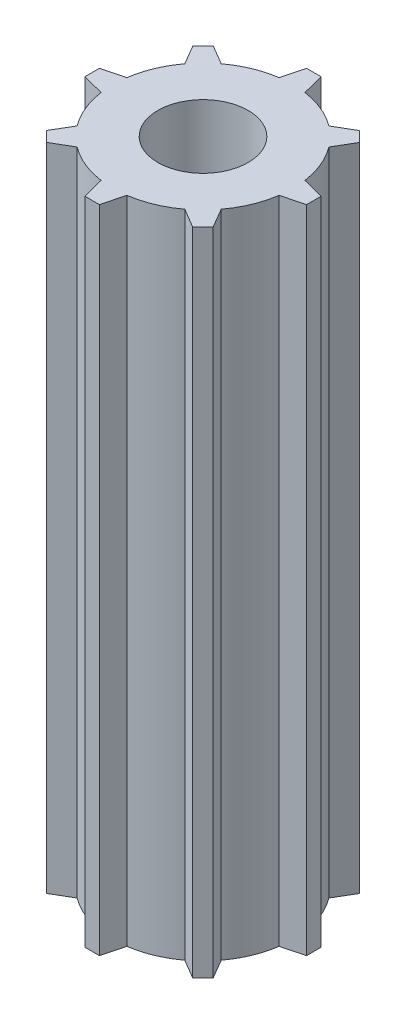
ISO-10303-21;
HEADER;
FILE_DESCRIPTION(('STEP AP214'),'2;1');
FILE_NAME('part.step','',(''),(''),'','','');
FILE_SCHEMA(('AUTOMOTIVE_DESIGN { 1 0 10303 214 1 1 1 1 }'));
ENDSEC;
DATA;
#1=APPLICATION_CONTEXT('core data for automotive mechanical design processes');
#2=APPLICATION_PROTOCOL_DEFINITION('international standard','automotive_design',2000,#1);
#3=PRODUCT_CONTEXT('',#1,'mechanical');
#4=PRODUCT('Part','Part','',(#3));
#5=PRODUCT_RELATED_PRODUCT_CATEGORY('part','',(#4));
#6=PRODUCT_DEFINITION_FORMATION('','',#4);
#7=PRODUCT_DEFINITION_CONTEXT('part definition',#1,'design');
#8=PRODUCT_DEFINITION('design','',#6,#7);
#9=PRODUCT_DEFINITION_SHAPE('','',#8);
#10=(LENGTH_UNIT() NAMED_UNIT(*) SI_UNIT(.MILLI.,.METRE.));
#11=(NAMED_UNIT(*) PLANE_ANGLE_UNIT() SI_UNIT($,.RADIAN.));
#12=(NAMED_UNIT(*) SI_UNIT($,.STERADIAN.) SOLID_ANGLE_UNIT());
#13=UNCERTAINTY_MEASURE_WITH_UNIT(LENGTH_MEASURE(1.E-05),#10,'distance_accuracy_value','');
#14=(GEOMETRIC_REPRESENTATION_CONTEXT(3) GLOBAL_UNCERTAINTY_ASSIGNED_CONTEXT((#13)) GLOBAL_UNIT_ASSIGNED_CONTEXT((#10,
#11,#12)) REPRESENTATION_CONTEXT('',''));
#15=CARTESIAN_POINT('',(0.,0.,0.));
#16=DIRECTION('',(0.,0.,1.));
#17=DIRECTION('',(1.,0.,0.));
#18=AXIS2_PLACEMENT_3D('',#15,#16,#17);
#19=CARTESIAN_POINT('',(-0.505053708742684,45.72,-7.78879571792839));
#20=DIRECTION('',(0.,0.,1.));
#21=DIRECTION('',(1.,0.,0.));
#22=AXIS2_PLACEMENT_3D('',#19,#20,#21);
#23=PLANE('',#22);
#24=DIRECTION('',(-1.,0.,0.));
#25=VECTOR('',#24,1.);
#26=CARTESIAN_POINT('',(-0.505053708742684,0.,-7.78879571792839));
#27=LINE('',#26,#25);
#28=CARTESIAN_POINT('',(0.510946291257316,0.,-7.78879571792839));
#29=VERTEX_POINT('',#28);
#30=CARTESIAN_POINT('',(-0.505053708742684,0.,-7.78879571792839));
#31=VERTEX_POINT('',#30);
#32=EDGE_CURVE('E279',#29,#31,#27,.T.);
#33=ORIENTED_EDGE('',*,*,#32,.T.);
#34=DIRECTION('',(0.,-1.,0.));
#35=VECTOR('',#34,1.);
#36=CARTESIAN_POINT('',(-0.505053708742684,45.72,-7.78879571792839));
#37=LINE('',#36,#35);
#38=CARTESIAN_POINT('',(-0.505053708742684,45.72,-7.78879571792839));
#39=VERTEX_POINT('',#38);
#40=EDGE_CURVE('E11',#39,#31,#37,.T.);
#41=ORIENTED_EDGE('',*,*,#40,.F.);
#42=DIRECTION('',(-1.,0.,0.));
#43=VECTOR('',#42,1.);
#44=CARTESIAN_POINT('',(-0.505053708742684,45.72,-7.78879571792839));
#45=LINE('',#44,#43);
#46=CARTESIAN_POINT('',(0.510946291257316,45.72,-7.78879571792839));
#47=VERTEX_POINT('',#46);
#48=EDGE_CURVE('E342',#47,#39,#45,.T.);
#49=ORIENTED_EDGE('',*,*,#48,.F.);
#50=DIRECTION('',(0.,-1.,0.));
#51=VECTOR('',#50,1.);
#52=CARTESIAN_POINT('',(0.510946291257316,45.72,-7.78879571792839));
#53=LINE('',#52,#51);
#54=EDGE_CURVE('E275',#47,#29,#53,.T.);
#55=ORIENTED_EDGE('',*,*,#54,.T.);
#56=EDGE_LOOP('',(#33,#41,#49,#55));
#57=FACE_BOUND('',#56,.T.);
#58=ADVANCED_FACE('F39',(#57),#23,.F.);
#59=CARTESIAN_POINT('',(-0.905835841654313,45.72,-6.25939506565726));
#60=DIRECTION('',(0.967337362785917,0.,0.253492458582867));
#61=DIRECTION('',(0.253492458582867,0.,-0.967337362785917));
#62=AXIS2_PLACEMENT_3D('',#59,#60,#61);
#63=PLANE('',#62);
#64=DIRECTION('',(-0.253492458582867,0.,0.967337362785917));
#65=VECTOR('',#64,1.);
#66=CARTESIAN_POINT('',(-0.905835841654313,0.,-6.25939506565726));
#67=LINE('',#66,#65);
#68=CARTESIAN_POINT('',(-0.905835841654313,0.,-6.25939506565726));
#69=VERTEX_POINT('',#68);
#70=EDGE_CURVE('E282',#31,#69,#67,.T.);
#71=ORIENTED_EDGE('',*,*,#70,.T.);
#72=DIRECTION('',(0.,-1.,0.));
#73=VECTOR('',#72,1.);
#74=CARTESIAN_POINT('',(-0.905835841654313,45.72,-6.25939506565726));
#75=LINE('',#74,#73);
#76=CARTESIAN_POINT('',(-0.905835841654313,45.72,-6.25939506565726));
#77=VERTEX_POINT('',#76);
#78=EDGE_CURVE('E47',#77,#69,#75,.T.);
#79=ORIENTED_EDGE('',*,*,#78,.F.);
#80=DIRECTION('',(-0.253492458582867,0.,0.967337362785917));
#81=VECTOR('',#80,1.);
#82=CARTESIAN_POINT('',(-0.905835841654313,45.72,-6.25939506565726));
#83=LINE('',#82,#81);
#84=EDGE_CURVE('E170',#39,#77,#83,.T.);
#85=ORIENTED_EDGE('',*,*,#84,.F.);
#86=ORIENTED_EDGE('',*,*,#40,.T.);
#87=EDGE_LOOP('',(#71,#79,#85,#86));
#88=FACE_BOUND('',#87,.T.);
#89=ADVANCED_FACE('F522',(#88),#63,.F.);
#90=CARTESIAN_POINT('',(0.,45.72,0.));
#91=DIRECTION('',(0.,-1.,0.));
#92=DIRECTION('',(0.,0.,-1.));
#93=AXIS2_PLACEMENT_3D('',#90,#91,#92);
#94=CYLINDRICAL_SURFACE('',#93,6.3246);
#95=CARTESIAN_POINT('',(0.,0.,0.));
#96=DIRECTION('',(0.,1.,0.));
#97=DIRECTION('',(0.,0.,1.));
#98=AXIS2_PLACEMENT_3D('',#95,#96,#97);
#99=CIRCLE('',#98,6.3246);
#100=CARTESIAN_POINT('',(-3.78553803077796,0.,-5.06658336332619));
#101=VERTEX_POINT('',#100);
#102=EDGE_CURVE('E285',#69,#101,#99,.T.);
#103=ORIENTED_EDGE('',*,*,#102,.T.);
#104=DIRECTION('',(0.,-1.,0.));
#105=VECTOR('',#104,1.);
#106=CARTESIAN_POINT('',(-3.78553803077796,45.72,-5.06658336332619));
#107=LINE('',#106,#105);
#108=CARTESIAN_POINT('',(-3.78553803077796,45.72,-5.06658336332619));
#109=VERTEX_POINT('',#108);
#110=EDGE_CURVE('E421',#109,#101,#107,.T.);
#111=ORIENTED_EDGE('',*,*,#110,.F.);
#112=CARTESIAN_POINT('',(0.,45.72,0.));
#113=DIRECTION('',(0.,1.,0.));
#114=DIRECTION('',(0.,0.,1.));
#115=AXIS2_PLACEMENT_3D('',#112,#113,#114);
#116=CIRCLE('',#115,6.3246);
#117=EDGE_CURVE('E429',#77,#109,#116,.T.);
#118=ORIENTED_EDGE('',*,*,#117,.F.);
#119=ORIENTED_EDGE('',*,*,#78,.T.);
#120=EDGE_LOOP('',(#103,#111,#118,#119));
#121=FACE_BOUND('',#120,.T.);
#122=ADVANCED_FACE('F427',(#121),#94,.T.);
#123=CARTESIAN_POINT('',(-3.78553803077796,45.72,-5.06658336332619));
#124=DIRECTION('',(-0.507876501584818,0.,0.861429892178096));
#125=DIRECTION('',(0.861429892178096,0.,0.507876501584818));
#126=AXIS2_PLACEMENT_3D('',#123,#124,#125);
#127=PLANE('',#126);
#128=DIRECTION('',(-0.861429892178096,0.,-0.507876501584818));
#129=VECTOR('',#128,1.);
#130=CARTESIAN_POINT('',(-3.78553803077796,0.,-5.06658336332619));
#131=LINE('',#130,#129);
#132=CARTESIAN_POINT('',(-5.14621668205375,0.,-5.86880385679407));
#133=VERTEX_POINT('',#132);
#134=EDGE_CURVE('E287',#101,#133,#131,.T.);
#135=ORIENTED_EDGE('',*,*,#134,.T.);
#136=DIRECTION('',(0.,-1.,0.));
#137=VECTOR('',#136,1.);
#138=CARTESIAN_POINT('',(-5.14621668205375,45.72,-5.86880385679407));
#139=LINE('',#138,#137);
#140=CARTESIAN_POINT('',(-5.14621668205375,45.72,-5.86880385679407));
#141=VERTEX_POINT('',#140);
#142=EDGE_CURVE('E418',#141,#133,#139,.T.);
#143=ORIENTED_EDGE('',*,*,#142,.F.);
#144=DIRECTION('',(-0.861429892178096,0.,-0.507876501584818));
#145=VECTOR('',#144,1.);
#146=CARTESIAN_POINT('',(-3.78553803077796,45.72,-5.06658336332619));
#147=LINE('',#146,#145);
#148=EDGE_CURVE('E447',#109,#141,#147,.T.);
#149=ORIENTED_EDGE('',*,*,#148,.F.);
#150=ORIENTED_EDGE('',*,*,#110,.T.);
#151=EDGE_LOOP('',(#135,#143,#149,#150));
#152=FACE_BOUND('',#151,.T.);
#153=ADVANCED_FACE('F438',(#152),#127,.F.);
#154=CARTESIAN_POINT('',(-5.86463717173928,45.72,-5.15038336710854));
#155=DIRECTION('',(0.707106781186549,0.,0.707106781186546));
#156=DIRECTION('',(0.707106781186546,0.,-0.707106781186549));
#157=AXIS2_PLACEMENT_3D('',#154,#155,#156);
#158=PLANE('',#157);
#159=DIRECTION('',(-0.707106781186546,0.,0.707106781186549));
#160=VECTOR('',#159,1.);
#161=CARTESIAN_POINT('',(-5.86463717173928,0.,-5.15038336710854));
#162=LINE('',#161,#160);
#163=CARTESIAN_POINT('',(-5.86463717173928,0.,-5.15038336710854));
#164=VERTEX_POINT('',#163);
#165=EDGE_CURVE('E289',#133,#164,#162,.T.);
#166=ORIENTED_EDGE('',*,*,#165,.T.);
#167=DIRECTION('',(0.,-1.,0.));
#168=VECTOR('',#167,1.);
#169=CARTESIAN_POINT('',(-5.86463717173928,45.72,-5.15038336710854));
#170=LINE('',#169,#168);
#171=CARTESIAN_POINT('',(-5.86463717173928,45.72,-5.15038336710854));
#172=VERTEX_POINT('',#171);
#173=EDGE_CURVE('E415',#172,#164,#170,.T.);
#174=ORIENTED_EDGE('',*,*,#173,.F.);
#175=DIRECTION('',(-0.707106781186546,0.,0.707106781186549));
#176=VECTOR('',#175,1.);
#177=CARTESIAN_POINT('',(-5.86463717173928,45.72,-5.15038336710854));
#178=LINE('',#177,#176);
#179=EDGE_CURVE('E444',#141,#172,#178,.T.);
#180=ORIENTED_EDGE('',*,*,#179,.F.);
#181=ORIENTED_EDGE('',*,*,#142,.T.);
#182=EDGE_LOOP('',(#166,#174,#180,#181));
#183=FACE_BOUND('',#182,.T.);
#184=ADVANCED_FACE('F442',(#183),#158,.F.);
#185=CARTESIAN_POINT('',(-5.06658336332745,45.72,-3.78553803077627));
#186=DIRECTION('',(0.863257045364629,0.,-0.504764572477438));
#187=DIRECTION('',(-0.504764572477438,0.,-0.863257045364629));
#188=AXIS2_PLACEMENT_3D('',#185,#186,#187);
#189=PLANE('',#188);
#190=DIRECTION('',(0.504764572477438,0.,0.863257045364629));
#191=VECTOR('',#190,1.);
#192=CARTESIAN_POINT('',(-5.06658336332745,0.,-3.78553803077627));
#193=LINE('',#192,#191);
#194=CARTESIAN_POINT('',(-5.06658336332745,0.,-3.78553803077627));
#195=VERTEX_POINT('',#194);
#196=EDGE_CURVE('E291',#164,#195,#193,.T.);
#197=ORIENTED_EDGE('',*,*,#196,.T.);
#198=DIRECTION('',(0.,-1.,0.));
#199=VECTOR('',#198,1.);
#200=CARTESIAN_POINT('',(-5.06658336332745,45.72,-3.78553803077627));
#201=LINE('',#200,#199);
#202=CARTESIAN_POINT('',(-5.06658336332745,45.72,-3.78553803077627));
#203=VERTEX_POINT('',#202);
#204=EDGE_CURVE('E412',#203,#195,#201,.T.);
#205=ORIENTED_EDGE('',*,*,#204,.F.);
#206=DIRECTION('',(0.504764572477438,0.,0.863257045364629));
#207=VECTOR('',#206,1.);
#208=CARTESIAN_POINT('',(-5.06658336332745,45.72,-3.78553803077627));
#209=LINE('',#208,#207);
#210=EDGE_CURVE('E446',#172,#203,#209,.T.);
#211=ORIENTED_EDGE('',*,*,#210,.F.);
#212=ORIENTED_EDGE('',*,*,#173,.T.);
#213=EDGE_LOOP('',(#197,#205,#211,#212));
#214=FACE_BOUND('',#213,.T.);
#215=ADVANCED_FACE('F535',(#214),#189,.F.);
#216=CARTESIAN_POINT('',(0.,45.72,0.));
#217=DIRECTION('',(0.,-1.,0.));
#218=DIRECTION('',(0.,0.,-1.));
#219=AXIS2_PLACEMENT_3D('',#216,#217,#218);
#220=CYLINDRICAL_SURFACE('',#219,6.3246);
#221=CARTESIAN_POINT('',(0.,0.,0.));
#222=DIRECTION('',(0.,1.,0.));
#223=DIRECTION('',(0.,0.,1.));
#224=AXIS2_PLACEMENT_3D('',#221,#222,#223);
#225=CIRCLE('',#224,6.3246);
#226=CARTESIAN_POINT('',(-6.25939506565756,0.,-0.905835841652232));
#227=VERTEX_POINT('',#226);
#228=EDGE_CURVE('E293',#195,#227,#225,.T.);
#229=ORIENTED_EDGE('',*,*,#228,.T.);
#230=DIRECTION('',(0.,-1.,0.));
#231=VECTOR('',#230,1.);
#232=CARTESIAN_POINT('',(-6.25939506565756,45.72,-0.905835841652232));
#233=LINE('',#232,#231);
#234=CARTESIAN_POINT('',(-6.25939506565756,45.72,-0.905835841652232));
#235=VERTEX_POINT('',#234);
#236=EDGE_CURVE('E409',#235,#227,#233,.T.);
#237=ORIENTED_EDGE('',*,*,#236,.F.);
#238=CARTESIAN_POINT('',(0.,45.72,0.));
#239=DIRECTION('',(0.,1.,0.));
#240=DIRECTION('',(0.,0.,1.));
#241=AXIS2_PLACEMENT_3D('',#238,#239,#240);
#242=CIRCLE('',#241,6.3246);
#243=EDGE_CURVE('E449',#203,#235,#242,.T.);
#244=ORIENTED_EDGE('',*,*,#243,.F.);
#245=ORIENTED_EDGE('',*,*,#204,.T.);
#246=EDGE_LOOP('',(#229,#237,#244,#245));
#247=FACE_BOUND('',#246,.T.);
#248=ADVANCED_FACE('F538',(#247),#220,.T.);
#249=CARTESIAN_POINT('',(-6.25939506565756,45.72,-0.905835841652232));
#250=DIRECTION('',(0.250000000000002,0.,0.968245836551854));
#251=DIRECTION('',(0.968245836551854,0.,-0.250000000000002));
#252=AXIS2_PLACEMENT_3D('',#249,#250,#251);
#253=PLANE('',#252);
#254=DIRECTION('',(-0.968245836551854,0.,0.250000000000002));
#255=VECTOR('',#254,1.);
#256=CARTESIAN_POINT('',(-6.25939506565756,0.,-0.905835841652232));
#257=LINE('',#256,#255);
#258=CARTESIAN_POINT('',(-7.78879571792839,0.,-0.510946291257314));
#259=VERTEX_POINT('',#258);
#260=EDGE_CURVE('E295',#227,#259,#257,.T.);
#261=ORIENTED_EDGE('',*,*,#260,.T.);
#262=DIRECTION('',(0.,-1.,0.));
#263=VECTOR('',#262,1.);
#264=CARTESIAN_POINT('',(-7.78879571792839,45.72,-0.510946291257314));
#265=LINE('',#264,#263);
#266=CARTESIAN_POINT('',(-7.78879571792839,45.72,-0.510946291257314));
#267=VERTEX_POINT('',#266);
#268=EDGE_CURVE('E406',#267,#259,#265,.T.);
#269=ORIENTED_EDGE('',*,*,#268,.F.);
#270=DIRECTION('',(-0.968245836551854,0.,0.250000000000002));
#271=VECTOR('',#270,1.);
#272=CARTESIAN_POINT('',(-6.25939506565756,45.72,-0.905835841652232));
#273=LINE('',#272,#271);
#274=EDGE_CURVE('E455',#235,#267,#273,.T.);
#275=ORIENTED_EDGE('',*,*,#274,.F.);
#276=ORIENTED_EDGE('',*,*,#236,.T.);
#277=EDGE_LOOP('',(#261,#269,#275,#276));
#278=FACE_BOUND('',#277,.T.);
#279=ADVANCED_FACE('F542',(#278),#253,.F.);
#280=CARTESIAN_POINT('',(-7.78879571792839,45.72,0.505053708742686));
#281=DIRECTION('',(1.,0.,0.));
#282=DIRECTION('',(0.,0.,-1.));
#283=AXIS2_PLACEMENT_3D('',#280,#281,#282);
#284=PLANE('',#283);
#285=DIRECTION('',(0.,0.,1.));
#286=VECTOR('',#285,1.);
#287=CARTESIAN_POINT('',(-7.78879571792839,0.,0.505053708742686));
#288=LINE('',#287,#286);
#289=CARTESIAN_POINT('',(-7.78879571792839,0.,0.505053708742686));
#290=VERTEX_POINT('',#289);
#291=EDGE_CURVE('E297',#259,#290,#288,.T.);
#292=ORIENTED_EDGE('',*,*,#291,.T.);
#293=DIRECTION('',(0.,-1.,0.));
#294=VECTOR('',#293,1.);
#295=CARTESIAN_POINT('',(-7.78879571792839,45.72,0.505053708742686));
#296=LINE('',#295,#294);
#297=CARTESIAN_POINT('',(-7.78879571792839,45.72,0.505053708742686));
#298=VERTEX_POINT('',#297);
#299=EDGE_CURVE('E403',#298,#290,#296,.T.);
#300=ORIENTED_EDGE('',*,*,#299,.F.);
#301=DIRECTION('',(0.,0.,1.));
#302=VECTOR('',#301,1.);
#303=CARTESIAN_POINT('',(-7.78879571792839,45.72,0.505053708742686));
#304=LINE('',#303,#302);
#305=EDGE_CURVE('E457',#267,#298,#304,.T.);
#306=ORIENTED_EDGE('',*,*,#305,.F.);
#307=ORIENTED_EDGE('',*,*,#268,.T.);
#308=EDGE_LOOP('',(#292,#300,#306,#307));
#309=FACE_BOUND('',#308,.T.);
#310=ADVANCED_FACE('F546',(#309),#284,.F.);
#311=CARTESIAN_POINT('',(-6.25939506565726,45.72,0.905835841654314));
#312=DIRECTION('',(0.253492458582867,0.,-0.967337362785917));
#313=DIRECTION('',(-0.967337362785917,0.,-0.253492458582867));
#314=AXIS2_PLACEMENT_3D('',#311,#312,#313);
#315=PLANE('',#314);
#316=DIRECTION('',(0.967337362785917,0.,0.253492458582867));
#317=VECTOR('',#316,1.);
#318=CARTESIAN_POINT('',(-6.25939506565726,0.,0.905835841654314));
#319=LINE('',#318,#317);
#320=CARTESIAN_POINT('',(-6.25939506565726,0.,0.905835841654314));
#321=VERTEX_POINT('',#320);
#322=EDGE_CURVE('E299',#290,#321,#319,.T.);
#323=ORIENTED_EDGE('',*,*,#322,.T.);
#324=DIRECTION('',(0.,-1.,0.));
#325=VECTOR('',#324,1.);
#326=CARTESIAN_POINT('',(-6.25939506565726,45.72,0.905835841654314));
#327=LINE('',#326,#325);
#328=CARTESIAN_POINT('',(-6.25939506565726,45.72,0.905835841654314));
#329=VERTEX_POINT('',#328);
#330=EDGE_CURVE('E400',#329,#321,#327,.T.);
#331=ORIENTED_EDGE('',*,*,#330,.F.);
#332=DIRECTION('',(0.967337362785917,0.,0.253492458582867));
#333=VECTOR('',#332,1.);
#334=CARTESIAN_POINT('',(-6.25939506565726,45.72,0.905835841654314));
#335=LINE('',#334,#333);
#336=EDGE_CURVE('E459',#298,#329,#335,.T.);
#337=ORIENTED_EDGE('',*,*,#336,.F.);
#338=ORIENTED_EDGE('',*,*,#299,.T.);
#339=EDGE_LOOP('',(#323,#331,#337,#338));
#340=FACE_BOUND('',#339,.T.);
#341=ADVANCED_FACE('F550',(#340),#315,.F.);
#342=CARTESIAN_POINT('',(0.,45.72,0.));
#343=DIRECTION('',(0.,-1.,0.));
#344=DIRECTION('',(0.,0.,-1.));
#345=AXIS2_PLACEMENT_3D('',#342,#343,#344);
#346=CYLINDRICAL_SURFACE('',#345,6.3246);
#347=CARTESIAN_POINT('',(0.,0.,0.));
#348=DIRECTION('',(0.,1.,0.));
#349=DIRECTION('',(0.,0.,1.));
#350=AXIS2_PLACEMENT_3D('',#347,#348,#349);
#351=CIRCLE('',#350,6.3246);
#352=CARTESIAN_POINT('',(-5.06658336332619,0.,3.78553803077796));
#353=VERTEX_POINT('',#352);
#354=EDGE_CURVE('E301',#321,#353,#351,.T.);
#355=ORIENTED_EDGE('',*,*,#354,.T.);
#356=DIRECTION('',(0.,-1.,0.));
#357=VECTOR('',#356,1.);
#358=CARTESIAN_POINT('',(-5.06658336332619,45.72,3.78553803077796));
#359=LINE('',#358,#357);
#360=CARTESIAN_POINT('',(-5.06658336332619,45.72,3.78553803077796));
#361=VERTEX_POINT('',#360);
#362=EDGE_CURVE('E397',#361,#353,#359,.T.);
#363=ORIENTED_EDGE('',*,*,#362,.F.);
#364=CARTESIAN_POINT('',(0.,45.72,0.));
#365=DIRECTION('',(0.,1.,0.));
#366=DIRECTION('',(0.,0.,1.));
#367=AXIS2_PLACEMENT_3D('',#364,#365,#366);
#368=CIRCLE('',#367,6.3246);
#369=EDGE_CURVE('E461',#329,#361,#368,.T.);
#370=ORIENTED_EDGE('',*,*,#369,.F.);
#371=ORIENTED_EDGE('',*,*,#330,.T.);
#372=EDGE_LOOP('',(#355,#363,#370,#371));
#373=FACE_BOUND('',#372,.T.);
#374=ADVANCED_FACE('F554',(#373),#346,.T.);
#375=CARTESIAN_POINT('',(-5.06658336332619,45.72,3.78553803077796));
#376=DIRECTION('',(0.861429892178096,0.,0.507876501584818));
#377=DIRECTION('',(0.507876501584818,0.,-0.861429892178096));
#378=AXIS2_PLACEMENT_3D('',#375,#376,#377);
#379=PLANE('',#378);
#380=DIRECTION('',(-0.507876501584818,0.,0.861429892178096));
#381=VECTOR('',#380,1.);
#382=CARTESIAN_POINT('',(-5.06658336332619,0.,3.78553803077796));
#383=LINE('',#382,#381);
#384=CARTESIAN_POINT('',(-5.86880385679407,0.,5.14621668205375));
#385=VERTEX_POINT('',#384);
#386=EDGE_CURVE('E303',#353,#385,#383,.T.);
#387=ORIENTED_EDGE('',*,*,#386,.T.);
#388=DIRECTION('',(0.,-1.,0.));
#389=VECTOR('',#388,1.);
#390=CARTESIAN_POINT('',(-5.86880385679407,45.72,5.14621668205375));
#391=LINE('',#390,#389);
#392=CARTESIAN_POINT('',(-5.86880385679407,45.72,5.14621668205375));
#393=VERTEX_POINT('',#392);
#394=EDGE_CURVE('E394',#393,#385,#391,.T.);
#395=ORIENTED_EDGE('',*,*,#394,.F.);
#396=DIRECTION('',(-0.507876501584818,0.,0.861429892178096));
#397=VECTOR('',#396,1.);
#398=CARTESIAN_POINT('',(-5.06658336332619,45.72,3.78553803077796));
#399=LINE('',#398,#397);
#400=EDGE_CURVE('E463',#361,#393,#399,.T.);
#401=ORIENTED_EDGE('',*,*,#400,.F.);
#402=ORIENTED_EDGE('',*,*,#362,.T.);
#403=EDGE_LOOP('',(#387,#395,#401,#402));
#404=FACE_BOUND('',#403,.T.);
#405=ADVANCED_FACE('F558',(#404),#379,.F.);
#406=CARTESIAN_POINT('',(-5.15038336710854,45.72,5.86463717173928));
#407=DIRECTION('',(0.707106781186546,0.,-0.707106781186549));
#408=DIRECTION('',(-0.707106781186549,0.,-0.707106781186546));
#409=AXIS2_PLACEMENT_3D('',#406,#407,#408);
#410=PLANE('',#409);
#411=DIRECTION('',(0.707106781186549,0.,0.707106781186546));
#412=VECTOR('',#411,1.);
#413=CARTESIAN_POINT('',(-5.15038336710854,0.,5.86463717173928));
#414=LINE('',#413,#412);
#415=CARTESIAN_POINT('',(-5.15038336710854,0.,5.86463717173928));
#416=VERTEX_POINT('',#415);
#417=EDGE_CURVE('E305',#385,#416,#414,.T.);
#418=ORIENTED_EDGE('',*,*,#417,.T.);
#419=DIRECTION('',(0.,-1.,0.));
#420=VECTOR('',#419,1.);
#421=CARTESIAN_POINT('',(-5.15038336710854,45.72,5.86463717173928));
#422=LINE('',#421,#420);
#423=CARTESIAN_POINT('',(-5.15038336710854,45.72,5.86463717173928));
#424=VERTEX_POINT('',#423);
#425=EDGE_CURVE('E391',#424,#416,#422,.T.);
#426=ORIENTED_EDGE('',*,*,#425,.F.);
#427=DIRECTION('',(0.707106781186549,0.,0.707106781186546));
#428=VECTOR('',#427,1.);
#429=CARTESIAN_POINT('',(-5.15038336710854,45.72,5.86463717173928));
#430=LINE('',#429,#428);
#431=EDGE_CURVE('E465',#393,#424,#430,.T.);
#432=ORIENTED_EDGE('',*,*,#431,.F.);
#433=ORIENTED_EDGE('',*,*,#394,.T.);
#434=EDGE_LOOP('',(#418,#426,#432,#433));
#435=FACE_BOUND('',#434,.T.);
#436=ADVANCED_FACE('F562',(#435),#410,.F.);
#437=CARTESIAN_POINT('',(-3.78553803077627,45.72,5.06658336332745));
#438=DIRECTION('',(-0.504764572477438,0.,-0.863257045364629));
#439=DIRECTION('',(-0.863257045364629,0.,0.504764572477438));
#440=AXIS2_PLACEMENT_3D('',#437,#438,#439);
#441=PLANE('',#440);
#442=DIRECTION('',(0.863257045364629,0.,-0.504764572477438));
#443=VECTOR('',#442,1.);
#444=CARTESIAN_POINT('',(-3.78553803077627,0.,5.06658336332745));
#445=LINE('',#444,#443);
#446=CARTESIAN_POINT('',(-3.78553803077627,0.,5.06658336332745));
#447=VERTEX_POINT('',#446);
#448=EDGE_CURVE('E307',#416,#447,#445,.T.);
#449=ORIENTED_EDGE('',*,*,#448,.T.);
#450=DIRECTION('',(0.,-1.,0.));
#451=VECTOR('',#450,1.);
#452=CARTESIAN_POINT('',(-3.78553803077627,45.72,5.06658336332745));
#453=LINE('',#452,#451);
#454=CARTESIAN_POINT('',(-3.78553803077627,45.72,5.06658336332745));
#455=VERTEX_POINT('',#454);
#456=EDGE_CURVE('E388',#455,#447,#453,.T.);
#457=ORIENTED_EDGE('',*,*,#456,.F.);
#458=DIRECTION('',(0.863257045364629,0.,-0.504764572477438));
#459=VECTOR('',#458,1.);
#460=CARTESIAN_POINT('',(-3.78553803077627,45.72,5.06658336332745));
#461=LINE('',#460,#459);
#462=EDGE_CURVE('E467',#424,#455,#461,.T.);
#463=ORIENTED_EDGE('',*,*,#462,.F.);
#464=ORIENTED_EDGE('',*,*,#425,.T.);
#465=EDGE_LOOP('',(#449,#457,#463,#464));
#466=FACE_BOUND('',#465,.T.);
#467=ADVANCED_FACE('F566',(#466),#441,.F.);
#468=CARTESIAN_POINT('',(0.,45.72,0.));
#469=DIRECTION('',(0.,-1.,0.));
#470=DIRECTION('',(0.,0.,-1.));
#471=AXIS2_PLACEMENT_3D('',#468,#469,#470);
#472=CYLINDRICAL_SURFACE('',#471,6.3246);
#473=CARTESIAN_POINT('',(0.,0.,0.));
#474=DIRECTION('',(0.,1.,0.));
#475=DIRECTION('',(0.,0.,1.));
#476=AXIS2_PLACEMENT_3D('',#473,#474,#475);
#477=CIRCLE('',#476,6.3246);
#478=CARTESIAN_POINT('',(-0.905835841652233,0.,6.25939506565756));
#479=VERTEX_POINT('',#478);
#480=EDGE_CURVE('E309',#447,#479,#477,.T.);
#481=ORIENTED_EDGE('',*,*,#480,.T.);
#482=DIRECTION('',(0.,-1.,0.));
#483=VECTOR('',#482,1.);
#484=CARTESIAN_POINT('',(-0.905835841652233,45.72,6.25939506565756));
#485=LINE('',#484,#483);
#486=CARTESIAN_POINT('',(-0.905835841652233,45.72,6.25939506565756));
#487=VERTEX_POINT('',#486);
#488=EDGE_CURVE('E385',#487,#479,#485,.T.);
#489=ORIENTED_EDGE('',*,*,#488,.F.);
#490=CARTESIAN_POINT('',(0.,45.72,0.));
#491=DIRECTION('',(0.,1.,0.));
#492=DIRECTION('',(0.,0.,1.));
#493=AXIS2_PLACEMENT_3D('',#490,#491,#492);
#494=CIRCLE('',#493,6.3246);
#495=EDGE_CURVE('E469',#455,#487,#494,.T.);
#496=ORIENTED_EDGE('',*,*,#495,.F.);
#497=ORIENTED_EDGE('',*,*,#456,.T.);
#498=EDGE_LOOP('',(#481,#489,#496,#497));
#499=FACE_BOUND('',#498,.T.);
#500=ADVANCED_FACE('F570',(#499),#472,.T.);
#501=CARTESIAN_POINT('',(-0.905835841652232,45.72,6.25939506565756));
#502=DIRECTION('',(0.968245836551854,0.,-0.250000000000002));
#503=DIRECTION('',(-0.250000000000002,0.,-0.968245836551854));
#504=AXIS2_PLACEMENT_3D('',#501,#502,#503);
#505=PLANE('',#504);
#506=DIRECTION('',(0.250000000000002,0.,0.968245836551854));
#507=VECTOR('',#506,1.);
#508=CARTESIAN_POINT('',(-0.905835841652232,0.,6.25939506565756));
#509=LINE('',#508,#507);
#510=CARTESIAN_POINT('',(-0.510946291257315,0.,7.78879571792839));
#511=VERTEX_POINT('',#510);
#512=EDGE_CURVE('E311',#479,#511,#509,.T.);
#513=ORIENTED_EDGE('',*,*,#512,.T.);
#514=DIRECTION('',(0.,-1.,0.));
#515=VECTOR('',#514,1.);
#516=CARTESIAN_POINT('',(-0.510946291257315,45.72,7.78879571792839));
#517=LINE('',#516,#515);
#518=CARTESIAN_POINT('',(-0.510946291257315,45.72,7.78879571792839));
#519=VERTEX_POINT('',#518);
#520=EDGE_CURVE('E382',#519,#511,#517,.T.);
#521=ORIENTED_EDGE('',*,*,#520,.F.);
#522=DIRECTION('',(0.250000000000002,0.,0.968245836551854));
#523=VECTOR('',#522,1.);
#524=CARTESIAN_POINT('',(-0.905835841652232,45.72,6.25939506565756));
#525=LINE('',#524,#523);
#526=EDGE_CURVE('E471',#487,#519,#525,.T.);
#527=ORIENTED_EDGE('',*,*,#526,.F.);
#528=ORIENTED_EDGE('',*,*,#488,.T.);
#529=EDGE_LOOP('',(#513,#521,#527,#528));
#530=FACE_BOUND('',#529,.T.);
#531=ADVANCED_FACE('F574',(#530),#505,.F.);
#532=CARTESIAN_POINT('',(0.505053708742685,45.72,7.78879571792839));
#533=DIRECTION('',(0.,0.,-1.));
#534=DIRECTION('',(-1.,0.,0.));
#535=AXIS2_PLACEMENT_3D('',#532,#533,#534);
#536=PLANE('',#535);
#537=DIRECTION('',(1.,0.,0.));
#538=VECTOR('',#537,1.);
#539=CARTESIAN_POINT('',(0.505053708742685,0.,7.78879571792839));
#540=LINE('',#539,#538);
#541=CARTESIAN_POINT('',(0.505053708742685,0.,7.78879571792839));
#542=VERTEX_POINT('',#541);
#543=EDGE_CURVE('E313',#511,#542,#540,.T.);
#544=ORIENTED_EDGE('',*,*,#543,.T.);
#545=DIRECTION('',(0.,-1.,0.));
#546=VECTOR('',#545,1.);
#547=CARTESIAN_POINT('',(0.505053708742685,45.72,7.78879571792839));
#548=LINE('',#547,#546);
#549=CARTESIAN_POINT('',(0.505053708742685,45.72,7.78879571792839));
#550=VERTEX_POINT('',#549);
#551=EDGE_CURVE('E379',#550,#542,#548,.T.);
#552=ORIENTED_EDGE('',*,*,#551,.F.);
#553=DIRECTION('',(1.,0.,0.));
#554=VECTOR('',#553,1.);
#555=CARTESIAN_POINT('',(0.505053708742685,45.72,7.78879571792839));
#556=LINE('',#555,#554);
#557=EDGE_CURVE('E473',#519,#550,#556,.T.);
#558=ORIENTED_EDGE('',*,*,#557,.F.);
#559=ORIENTED_EDGE('',*,*,#520,.T.);
#560=EDGE_LOOP('',(#544,#552,#558,#559));
#561=FACE_BOUND('',#560,.T.);
#562=ADVANCED_FACE('F578',(#561),#536,.F.);
#563=CARTESIAN_POINT('',(0.905835841654314,45.72,6.25939506565726));
#564=DIRECTION('',(-0.967337362785917,0.,-0.253492458582867));
#565=DIRECTION('',(-0.253492458582867,0.,0.967337362785917));
#566=AXIS2_PLACEMENT_3D('',#563,#564,#565);
#567=PLANE('',#566);
#568=DIRECTION('',(0.253492458582867,0.,-0.967337362785917));
#569=VECTOR('',#568,1.);
#570=CARTESIAN_POINT('',(0.905835841654314,0.,6.25939506565726));
#571=LINE('',#570,#569);
#572=CARTESIAN_POINT('',(0.905835841654314,0.,6.25939506565726));
#573=VERTEX_POINT('',#572);
#574=EDGE_CURVE('E315',#542,#573,#571,.T.);
#575=ORIENTED_EDGE('',*,*,#574,.T.);
#576=DIRECTION('',(0.,-1.,0.));
#577=VECTOR('',#576,1.);
#578=CARTESIAN_POINT('',(0.905835841654314,45.72,6.25939506565726));
#579=LINE('',#578,#577);
#580=CARTESIAN_POINT('',(0.905835841654314,45.72,6.25939506565726));
#581=VERTEX_POINT('',#580);
#582=EDGE_CURVE('E376',#581,#573,#579,.T.);
#583=ORIENTED_EDGE('',*,*,#582,.F.);
#584=DIRECTION('',(0.253492458582867,0.,-0.967337362785917));
#585=VECTOR('',#584,1.);
#586=CARTESIAN_POINT('',(0.905835841654314,45.72,6.25939506565726));
#587=LINE('',#586,#585);
#588=EDGE_CURVE('E475',#550,#581,#587,.T.);
#589=ORIENTED_EDGE('',*,*,#588,.F.);
#590=ORIENTED_EDGE('',*,*,#551,.T.);
#591=EDGE_LOOP('',(#575,#583,#589,#590));
#592=FACE_BOUND('',#591,.T.);
#593=ADVANCED_FACE('F582',(#592),#567,.F.);
#594=CARTESIAN_POINT('',(0.,45.72,0.));
#595=DIRECTION('',(0.,-1.,0.));
#596=DIRECTION('',(0.,0.,-1.));
#597=AXIS2_PLACEMENT_3D('',#594,#595,#596);
#598=CYLINDRICAL_SURFACE('',#597,6.3246);
#599=CARTESIAN_POINT('',(0.,0.,0.));
#600=DIRECTION('',(0.,1.,0.));
#601=DIRECTION('',(0.,0.,1.));
#602=AXIS2_PLACEMENT_3D('',#599,#600,#601);
#603=CIRCLE('',#602,6.3246);
#604=CARTESIAN_POINT('',(3.78553803077796,0.,5.06658336332619));
#605=VERTEX_POINT('',#604);
#606=EDGE_CURVE('E317',#573,#605,#603,.T.);
#607=ORIENTED_EDGE('',*,*,#606,.T.);
#608=DIRECTION('',(0.,-1.,0.));
#609=VECTOR('',#608,1.);
#610=CARTESIAN_POINT('',(3.78553803077796,45.72,5.06658336332619));
#611=LINE('',#610,#609);
#612=CARTESIAN_POINT('',(3.78553803077796,45.72,5.06658336332619));
#613=VERTEX_POINT('',#612);
#614=EDGE_CURVE('E373',#613,#605,#611,.T.);
#615=ORIENTED_EDGE('',*,*,#614,.F.);
#616=CARTESIAN_POINT('',(0.,45.72,0.));
#617=DIRECTION('',(0.,1.,0.));
#618=DIRECTION('',(0.,0.,1.));
#619=AXIS2_PLACEMENT_3D('',#616,#617,#618);
#620=CIRCLE('',#619,6.3246);
#621=EDGE_CURVE('E477',#581,#613,#620,.T.);
#622=ORIENTED_EDGE('',*,*,#621,.F.);
#623=ORIENTED_EDGE('',*,*,#582,.T.);
#624=EDGE_LOOP('',(#607,#615,#622,#623));
#625=FACE_BOUND('',#624,.T.);
#626=ADVANCED_FACE('F586',(#625),#598,.T.);
#627=CARTESIAN_POINT('',(3.78553803077796,45.72,5.06658336332619));
#628=DIRECTION('',(0.507876501584818,0.,-0.861429892178096));
#629=DIRECTION('',(-0.861429892178096,0.,-0.507876501584818));
#630=AXIS2_PLACEMENT_3D('',#627,#628,#629);
#631=PLANE('',#630);
#632=DIRECTION('',(0.861429892178096,0.,0.507876501584818));
#633=VECTOR('',#632,1.);
#634=CARTESIAN_POINT('',(3.78553803077796,0.,5.06658336332619));
#635=LINE('',#634,#633);
#636=CARTESIAN_POINT('',(5.14621668205375,0.,5.86880385679407));
#637=VERTEX_POINT('',#636);
#638=EDGE_CURVE('E319',#605,#637,#635,.T.);
#639=ORIENTED_EDGE('',*,*,#638,.T.);
#640=DIRECTION('',(0.,-1.,0.));
#641=VECTOR('',#640,1.);
#642=CARTESIAN_POINT('',(5.14621668205375,45.72,5.86880385679407));
#643=LINE('',#642,#641);
#644=CARTESIAN_POINT('',(5.14621668205375,45.72,5.86880385679407));
#645=VERTEX_POINT('',#644);
#646=EDGE_CURVE('E370',#645,#637,#643,.T.);
#647=ORIENTED_EDGE('',*,*,#646,.F.);
#648=DIRECTION('',(0.861429892178096,0.,0.507876501584818));
#649=VECTOR('',#648,1.);
#650=CARTESIAN_POINT('',(3.78553803077796,45.72,5.06658336332619));
#651=LINE('',#650,#649);
#652=EDGE_CURVE('E479',#613,#645,#651,.T.);
#653=ORIENTED_EDGE('',*,*,#652,.F.);
#654=ORIENTED_EDGE('',*,*,#614,.T.);
#655=EDGE_LOOP('',(#639,#647,#653,#654));
#656=FACE_BOUND('',#655,.T.);
#657=ADVANCED_FACE('F590',(#656),#631,.F.);
#658=CARTESIAN_POINT('',(5.86463717173928,45.72,5.15038336710854));
#659=DIRECTION('',(-0.707106781186549,0.,-0.707106781186546));
#660=DIRECTION('',(-0.707106781186546,0.,0.707106781186549));
#661=AXIS2_PLACEMENT_3D('',#658,#659,#660);
#662=PLANE('',#661);
#663=DIRECTION('',(0.707106781186546,0.,-0.707106781186549));
#664=VECTOR('',#663,1.);
#665=CARTESIAN_POINT('',(5.86463717173928,0.,5.15038336710854));
#666=LINE('',#665,#664);
#667=CARTESIAN_POINT('',(5.86463717173928,0.,5.15038336710854));
#668=VERTEX_POINT('',#667);
#669=EDGE_CURVE('E321',#637,#668,#666,.T.);
#670=ORIENTED_EDGE('',*,*,#669,.T.);
#671=DIRECTION('',(0.,-1.,0.));
#672=VECTOR('',#671,1.);
#673=CARTESIAN_POINT('',(5.86463717173928,45.72,5.15038336710854));
#674=LINE('',#673,#672);
#675=CARTESIAN_POINT('',(5.86463717173928,45.72,5.15038336710854));
#676=VERTEX_POINT('',#675);
#677=EDGE_CURVE('E367',#676,#668,#674,.T.);
#678=ORIENTED_EDGE('',*,*,#677,.F.);
#679=DIRECTION('',(0.707106781186546,0.,-0.707106781186549));
#680=VECTOR('',#679,1.);
#681=CARTESIAN_POINT('',(5.86463717173928,45.72,5.15038336710854));
#682=LINE('',#681,#680);
#683=EDGE_CURVE('E481',#645,#676,#682,.T.);
#684=ORIENTED_EDGE('',*,*,#683,.F.);
#685=ORIENTED_EDGE('',*,*,#646,.T.);
#686=EDGE_LOOP('',(#670,#678,#684,#685));
#687=FACE_BOUND('',#686,.T.);
#688=ADVANCED_FACE('F594',(#687),#662,.F.);
#689=CARTESIAN_POINT('',(5.06658336332745,45.72,3.78553803077627));
#690=DIRECTION('',(-0.863257045364629,0.,0.504764572477438));
#691=DIRECTION('',(0.504764572477438,0.,0.863257045364629));
#692=AXIS2_PLACEMENT_3D('',#689,#690,#691);
#693=PLANE('',#692);
#694=DIRECTION('',(-0.504764572477438,0.,-0.863257045364629));
#695=VECTOR('',#694,1.);
#696=CARTESIAN_POINT('',(5.06658336332745,0.,3.78553803077627));
#697=LINE('',#696,#695);
#698=CARTESIAN_POINT('',(5.06658336332745,0.,3.78553803077627));
#699=VERTEX_POINT('',#698);
#700=EDGE_CURVE('E323',#668,#699,#697,.T.);
#701=ORIENTED_EDGE('',*,*,#700,.T.);
#702=DIRECTION('',(0.,-1.,0.));
#703=VECTOR('',#702,1.);
#704=CARTESIAN_POINT('',(5.06658336332745,45.72,3.78553803077627));
#705=LINE('',#704,#703);
#706=CARTESIAN_POINT('',(5.06658336332745,45.72,3.78553803077627));
#707=VERTEX_POINT('',#706);
#708=EDGE_CURVE('E364',#707,#699,#705,.T.);
#709=ORIENTED_EDGE('',*,*,#708,.F.);
#710=DIRECTION('',(-0.504764572477438,0.,-0.863257045364629));
#711=VECTOR('',#710,1.);
#712=CARTESIAN_POINT('',(5.06658336332745,45.72,3.78553803077627));
#713=LINE('',#712,#711);
#714=EDGE_CURVE('E483',#676,#707,#713,.T.);
#715=ORIENTED_EDGE('',*,*,#714,.F.);
#716=ORIENTED_EDGE('',*,*,#677,.T.);
#717=EDGE_LOOP('',(#701,#709,#715,#716));
#718=FACE_BOUND('',#717,.T.);
#719=ADVANCED_FACE('F598',(#718),#693,.F.);
#720=CARTESIAN_POINT('',(0.,45.72,0.));
#721=DIRECTION('',(0.,-1.,0.));
#722=DIRECTION('',(0.,0.,-1.));
#723=AXIS2_PLACEMENT_3D('',#720,#721,#722);
#724=CYLINDRICAL_SURFACE('',#723,6.3246);
#725=CARTESIAN_POINT('',(0.,0.,0.));
#726=DIRECTION('',(0.,1.,0.));
#727=DIRECTION('',(0.,0.,1.));
#728=AXIS2_PLACEMENT_3D('',#725,#726,#727);
#729=CIRCLE('',#728,6.3246);
#730=CARTESIAN_POINT('',(6.25939506565756,0.,0.905835841652233));
#731=VERTEX_POINT('',#730);
#732=EDGE_CURVE('E325',#699,#731,#729,.T.);
#733=ORIENTED_EDGE('',*,*,#732,.T.);
#734=DIRECTION('',(0.,-1.,0.));
#735=VECTOR('',#734,1.);
#736=CARTESIAN_POINT('',(6.25939506565756,45.72,0.905835841652233));
#737=LINE('',#736,#735);
#738=CARTESIAN_POINT('',(6.25939506565756,45.72,0.905835841652233));
#739=VERTEX_POINT('',#738);
#740=EDGE_CURVE('E361',#739,#731,#737,.T.);
#741=ORIENTED_EDGE('',*,*,#740,.F.);
#742=CARTESIAN_POINT('',(0.,45.72,0.));
#743=DIRECTION('',(0.,1.,0.));
#744=DIRECTION('',(0.,0.,1.));
#745=AXIS2_PLACEMENT_3D('',#742,#743,#744);
#746=CIRCLE('',#745,6.3246);
#747=EDGE_CURVE('E485',#707,#739,#746,.T.);
#748=ORIENTED_EDGE('',*,*,#747,.F.);
#749=ORIENTED_EDGE('',*,*,#708,.T.);
#750=EDGE_LOOP('',(#733,#741,#748,#749));
#751=FACE_BOUND('',#750,.T.);
#752=ADVANCED_FACE('F602',(#751),#724,.T.);
#753=CARTESIAN_POINT('',(6.25939506565756,45.72,0.905835841652232));
#754=DIRECTION('',(-0.250000000000002,0.,-0.968245836551854));
#755=DIRECTION('',(-0.968245836551854,0.,0.250000000000002));
#756=AXIS2_PLACEMENT_3D('',#753,#754,#755);
#757=PLANE('',#756);
#758=DIRECTION('',(0.968245836551854,0.,-0.250000000000002));
#759=VECTOR('',#758,1.);
#760=CARTESIAN_POINT('',(6.25939506565756,0.,0.905835841652232));
#761=LINE('',#760,#759);
#762=CARTESIAN_POINT('',(7.78879571792839,0.,0.510946291257315));
#763=VERTEX_POINT('',#762);
#764=EDGE_CURVE('E327',#731,#763,#761,.T.);
#765=ORIENTED_EDGE('',*,*,#764,.T.);
#766=DIRECTION('',(0.,-1.,0.));
#767=VECTOR('',#766,1.);
#768=CARTESIAN_POINT('',(7.78879571792839,45.72,0.510946291257315));
#769=LINE('',#768,#767);
#770=CARTESIAN_POINT('',(7.78879571792839,45.72,0.510946291257315));
#771=VERTEX_POINT('',#770);
#772=EDGE_CURVE('E358',#771,#763,#769,.T.);
#773=ORIENTED_EDGE('',*,*,#772,.F.);
#774=DIRECTION('',(0.968245836551854,0.,-0.250000000000002));
#775=VECTOR('',#774,1.);
#776=CARTESIAN_POINT('',(6.25939506565756,45.72,0.905835841652232));
#777=LINE('',#776,#775);
#778=EDGE_CURVE('E487',#739,#771,#777,.T.);
#779=ORIENTED_EDGE('',*,*,#778,.F.);
#780=ORIENTED_EDGE('',*,*,#740,.T.);
#781=EDGE_LOOP('',(#765,#773,#779,#780));
#782=FACE_BOUND('',#781,.T.);
#783=ADVANCED_FACE('F606',(#782),#757,.F.);
#784=CARTESIAN_POINT('',(7.78879571792839,45.72,-0.505053708742685));
#785=DIRECTION('',(-1.,0.,0.));
#786=DIRECTION('',(0.,0.,1.));
#787=AXIS2_PLACEMENT_3D('',#784,#785,#786);
#788=PLANE('',#787);
#789=DIRECTION('',(0.,0.,-1.));
#790=VECTOR('',#789,1.);
#791=CARTESIAN_POINT('',(7.78879571792839,0.,-0.505053708742685));
#792=LINE('',#791,#790);
#793=CARTESIAN_POINT('',(7.78879571792839,0.,-0.505053708742685));
#794=VERTEX_POINT('',#793);
#795=EDGE_CURVE('E329',#763,#794,#792,.T.);
#796=ORIENTED_EDGE('',*,*,#795,.T.);
#797=DIRECTION('',(0.,-1.,0.));
#798=VECTOR('',#797,1.);
#799=CARTESIAN_POINT('',(7.78879571792839,45.72,-0.505053708742685));
#800=LINE('',#799,#798);
#801=CARTESIAN_POINT('',(7.78879571792839,45.72,-0.505053708742685));
#802=VERTEX_POINT('',#801);
#803=EDGE_CURVE('E355',#802,#794,#800,.T.);
#804=ORIENTED_EDGE('',*,*,#803,.F.);
#805=DIRECTION('',(0.,0.,-1.));
#806=VECTOR('',#805,1.);
#807=CARTESIAN_POINT('',(7.78879571792839,45.72,-0.505053708742685));
#808=LINE('',#807,#806);
#809=EDGE_CURVE('E489',#771,#802,#808,.T.);
#810=ORIENTED_EDGE('',*,*,#809,.F.);
#811=ORIENTED_EDGE('',*,*,#772,.T.);
#812=EDGE_LOOP('',(#796,#804,#810,#811));
#813=FACE_BOUND('',#812,.T.);
#814=ADVANCED_FACE('F610',(#813),#788,.F.);
#815=CARTESIAN_POINT('',(6.25939506565726,45.72,-0.905835841654313));
#816=DIRECTION('',(-0.253492458582867,0.,0.967337362785917));
#817=DIRECTION('',(0.967337362785917,0.,0.253492458582867));
#818=AXIS2_PLACEMENT_3D('',#815,#816,#817);
#819=PLANE('',#818);
#820=DIRECTION('',(-0.967337362785917,0.,-0.253492458582867));
#821=VECTOR('',#820,1.);
#822=CARTESIAN_POINT('',(6.25939506565726,0.,-0.905835841654313));
#823=LINE('',#822,#821);
#824=CARTESIAN_POINT('',(6.25939506565726,0.,-0.905835841654313));
#825=VERTEX_POINT('',#824);
#826=EDGE_CURVE('E331',#794,#825,#823,.T.);
#827=ORIENTED_EDGE('',*,*,#826,.T.);
#828=DIRECTION('',(0.,-1.,0.));
#829=VECTOR('',#828,1.);
#830=CARTESIAN_POINT('',(6.25939506565726,45.72,-0.905835841654313));
#831=LINE('',#830,#829);
#832=CARTESIAN_POINT('',(6.25939506565726,45.72,-0.905835841654313));
#833=VERTEX_POINT('',#832);
#834=EDGE_CURVE('E352',#833,#825,#831,.T.);
#835=ORIENTED_EDGE('',*,*,#834,.F.);
#836=DIRECTION('',(-0.967337362785917,0.,-0.253492458582867));
#837=VECTOR('',#836,1.);
#838=CARTESIAN_POINT('',(6.25939506565726,45.72,-0.905835841654313));
#839=LINE('',#838,#837);
#840=EDGE_CURVE('E491',#802,#833,#839,.T.);
#841=ORIENTED_EDGE('',*,*,#840,.F.);
#842=ORIENTED_EDGE('',*,*,#803,.T.);
#843=EDGE_LOOP('',(#827,#835,#841,#842));
#844=FACE_BOUND('',#843,.T.);
#845=ADVANCED_FACE('F614',(#844),#819,.F.);
#846=CARTESIAN_POINT('',(0.,45.72,0.));
#847=DIRECTION('',(0.,-1.,0.));
#848=DIRECTION('',(0.,0.,-1.));
#849=AXIS2_PLACEMENT_3D('',#846,#847,#848);
#850=CYLINDRICAL_SURFACE('',#849,6.3246);
#851=CARTESIAN_POINT('',(0.,0.,0.));
#852=DIRECTION('',(0.,1.,0.));
#853=DIRECTION('',(0.,0.,1.));
#854=AXIS2_PLACEMENT_3D('',#851,#852,#853);
#855=CIRCLE('',#854,6.3246);
#856=CARTESIAN_POINT('',(5.06658336332619,0.,-3.78553803077796));
#857=VERTEX_POINT('',#856);
#858=EDGE_CURVE('E333',#825,#857,#855,.T.);
#859=ORIENTED_EDGE('',*,*,#858,.T.);
#860=DIRECTION('',(0.,-1.,0.));
#861=VECTOR('',#860,1.);
#862=CARTESIAN_POINT('',(5.06658336332619,45.72,-3.78553803077796));
#863=LINE('',#862,#861);
#864=CARTESIAN_POINT('',(5.06658336332619,45.72,-3.78553803077796));
#865=VERTEX_POINT('',#864);
#866=EDGE_CURVE('E349',#865,#857,#863,.T.);
#867=ORIENTED_EDGE('',*,*,#866,.F.);
#868=CARTESIAN_POINT('',(0.,45.72,0.));
#869=DIRECTION('',(0.,1.,0.));
#870=DIRECTION('',(0.,0.,1.));
#871=AXIS2_PLACEMENT_3D('',#868,#869,#870);
#872=CIRCLE('',#871,6.3246);
#873=EDGE_CURVE('E493',#833,#865,#872,.T.);
#874=ORIENTED_EDGE('',*,*,#873,.F.);
#875=ORIENTED_EDGE('',*,*,#834,.T.);
#876=EDGE_LOOP('',(#859,#867,#874,#875));
#877=FACE_BOUND('',#876,.T.);
#878=ADVANCED_FACE('F618',(#877),#850,.T.);
#879=CARTESIAN_POINT('',(5.06658336332619,45.72,-3.78553803077796));
#880=DIRECTION('',(-0.861429892178096,0.,-0.507876501584818));
#881=DIRECTION('',(-0.507876501584818,0.,0.861429892178096));
#882=AXIS2_PLACEMENT_3D('',#879,#880,#881);
#883=PLANE('',#882);
#884=DIRECTION('',(0.507876501584818,0.,-0.861429892178096));
#885=VECTOR('',#884,1.);
#886=CARTESIAN_POINT('',(5.06658336332619,0.,-3.78553803077796));
#887=LINE('',#886,#885);
#888=CARTESIAN_POINT('',(5.86880385679407,0.,-5.14621668205375));
#889=VERTEX_POINT('',#888);
#890=EDGE_CURVE('E335',#857,#889,#887,.T.);
#891=ORIENTED_EDGE('',*,*,#890,.T.);
#892=DIRECTION('',(0.,-1.,0.));
#893=VECTOR('',#892,1.);
#894=CARTESIAN_POINT('',(5.86880385679407,45.72,-5.14621668205375));
#895=LINE('',#894,#893);
#896=CARTESIAN_POINT('',(5.86880385679407,45.72,-5.14621668205375));
#897=VERTEX_POINT('',#896);
#898=EDGE_CURVE('E346',#897,#889,#895,.T.);
#899=ORIENTED_EDGE('',*,*,#898,.F.);
#900=DIRECTION('',(0.507876501584818,0.,-0.861429892178096));
#901=VECTOR('',#900,1.);
#902=CARTESIAN_POINT('',(5.06658336332619,45.72,-3.78553803077796));
#903=LINE('',#902,#901);
#904=EDGE_CURVE('E495',#865,#897,#903,.T.);
#905=ORIENTED_EDGE('',*,*,#904,.F.);
#906=ORIENTED_EDGE('',*,*,#866,.T.);
#907=EDGE_LOOP('',(#891,#899,#905,#906));
#908=FACE_BOUND('',#907,.T.);
#909=ADVANCED_FACE('F501',(#908),#883,.F.);
#910=CARTESIAN_POINT('',(5.15038336710854,45.72,-5.86463717173928));
#911=DIRECTION('',(-0.707106781186546,0.,0.707106781186549));
#912=DIRECTION('',(0.707106781186549,0.,0.707106781186546));
#913=AXIS2_PLACEMENT_3D('',#910,#911,#912);
#914=PLANE('',#913);
#915=DIRECTION('',(-0.707106781186549,0.,-0.707106781186546));
#916=VECTOR('',#915,1.);
#917=CARTESIAN_POINT('',(5.15038336710854,0.,-5.86463717173928));
#918=LINE('',#917,#916);
#919=CARTESIAN_POINT('',(5.15038336710854,0.,-5.86463717173928));
#920=VERTEX_POINT('',#919);
#921=EDGE_CURVE('E337',#889,#920,#918,.T.);
#922=ORIENTED_EDGE('',*,*,#921,.T.);
#923=DIRECTION('',(0.,-1.,0.));
#924=VECTOR('',#923,1.);
#925=CARTESIAN_POINT('',(5.15038336710854,45.72,-5.86463717173928));
#926=LINE('',#925,#924);
#927=CARTESIAN_POINT('',(5.15038336710854,45.72,-5.86463717173928));
#928=VERTEX_POINT('',#927);
#929=EDGE_CURVE('E270',#928,#920,#926,.T.);
#930=ORIENTED_EDGE('',*,*,#929,.F.);
#931=DIRECTION('',(-0.707106781186549,0.,-0.707106781186546));
#932=VECTOR('',#931,1.);
#933=CARTESIAN_POINT('',(5.15038336710854,45.72,-5.86463717173928));
#934=LINE('',#933,#932);
#935=EDGE_CURVE('E261',#897,#928,#934,.T.);
#936=ORIENTED_EDGE('',*,*,#935,.F.);
#937=ORIENTED_EDGE('',*,*,#898,.T.);
#938=EDGE_LOOP('',(#922,#930,#936,#937));
#939=FACE_BOUND('',#938,.T.);
#940=ADVANCED_FACE('F505',(#939),#914,.F.);
#941=CARTESIAN_POINT('',(3.78553803077627,45.72,-5.06658336332745));
#942=DIRECTION('',(0.504764572477438,0.,0.863257045364629));
#943=DIRECTION('',(0.863257045364629,0.,-0.504764572477438));
#944=AXIS2_PLACEMENT_3D('',#941,#942,#943);
#945=PLANE('',#944);
#946=DIRECTION('',(-0.863257045364629,0.,0.504764572477438));
#947=VECTOR('',#946,1.);
#948=CARTESIAN_POINT('',(3.78553803077627,0.,-5.06658336332745));
#949=LINE('',#948,#947);
#950=CARTESIAN_POINT('',(3.78553803077627,0.,-5.06658336332745));
#951=VERTEX_POINT('',#950);
#952=EDGE_CURVE('E269',#920,#951,#949,.T.);
#953=ORIENTED_EDGE('',*,*,#952,.T.);
#954=DIRECTION('',(0.,-1.,0.));
#955=VECTOR('',#954,1.);
#956=CARTESIAN_POINT('',(3.78553803077627,45.72,-5.06658336332745));
#957=LINE('',#956,#955);
#958=CARTESIAN_POINT('',(3.78553803077627,45.72,-5.06658336332745));
#959=VERTEX_POINT('',#958);
#960=EDGE_CURVE('E266',#959,#951,#957,.T.);
#961=ORIENTED_EDGE('',*,*,#960,.F.);
#962=DIRECTION('',(-0.863257045364629,0.,0.504764572477438));
#963=VECTOR('',#962,1.);
#964=CARTESIAN_POINT('',(3.78553803077627,45.72,-5.06658336332745));
#965=LINE('',#964,#963);
#966=EDGE_CURVE('E255',#928,#959,#965,.T.);
#967=ORIENTED_EDGE('',*,*,#966,.F.);
#968=ORIENTED_EDGE('',*,*,#929,.T.);
#969=EDGE_LOOP('',(#953,#961,#967,#968));
#970=FACE_BOUND('',#969,.T.);
#971=ADVANCED_FACE('F267',(#970),#945,.F.);
#972=CARTESIAN_POINT('',(0.,45.72,0.));
#973=DIRECTION('',(0.,-1.,0.));
#974=DIRECTION('',(0.,0.,-1.));
#975=AXIS2_PLACEMENT_3D('',#972,#973,#974);
#976=CYLINDRICAL_SURFACE('',#975,6.3246);
#977=CARTESIAN_POINT('',(0.,0.,0.));
#978=DIRECTION('',(0.,1.,0.));
#979=DIRECTION('',(0.,0.,1.));
#980=AXIS2_PLACEMENT_3D('',#977,#978,#979);
#981=CIRCLE('',#980,6.3246);
#982=CARTESIAN_POINT('',(0.905835841652232,0.,-6.25939506565756));
#983=VERTEX_POINT('',#982);
#984=EDGE_CURVE('E156',#951,#983,#981,.T.);
#985=ORIENTED_EDGE('',*,*,#984,.T.);
#986=DIRECTION('',(0.,-1.,0.));
#987=VECTOR('',#986,1.);
#988=CARTESIAN_POINT('',(0.905835841652232,45.72,-6.25939506565756));
#989=LINE('',#988,#987);
#990=CARTESIAN_POINT('',(0.905835841652232,45.72,-6.25939506565756));
#991=VERTEX_POINT('',#990);
#992=EDGE_CURVE('E271',#991,#983,#989,.T.);
#993=ORIENTED_EDGE('',*,*,#992,.F.);
#994=CARTESIAN_POINT('',(0.,45.72,0.));
#995=DIRECTION('',(0.,1.,0.));
#996=DIRECTION('',(0.,0.,1.));
#997=AXIS2_PLACEMENT_3D('',#994,#995,#996);
#998=CIRCLE('',#997,6.3246);
#999=EDGE_CURVE('E259',#959,#991,#998,.T.);
#1000=ORIENTED_EDGE('',*,*,#999,.F.);
#1001=ORIENTED_EDGE('',*,*,#960,.T.);
#1002=EDGE_LOOP('',(#985,#993,#1000,#1001));
#1003=FACE_BOUND('',#1002,.T.);
#1004=ADVANCED_FACE('F273',(#1003),#976,.T.);
#1005=CARTESIAN_POINT('',(0.905835841652233,45.72,-6.25939506565756));
#1006=DIRECTION('',(-0.968245836551854,0.,0.250000000000002));
#1007=DIRECTION('',(0.250000000000002,0.,0.968245836551854));
#1008=AXIS2_PLACEMENT_3D('',#1005,#1006,#1007);
#1009=PLANE('',#1008);
#1010=DIRECTION('',(-0.250000000000002,0.,-0.968245836551854));
#1011=VECTOR('',#1010,1.);
#1012=CARTESIAN_POINT('',(0.905835841652233,0.,-6.25939506565756));
#1013=LINE('',#1012,#1011);
#1014=EDGE_CURVE('E162',#983,#29,#1013,.T.);
#1015=ORIENTED_EDGE('',*,*,#1014,.T.);
#1016=ORIENTED_EDGE('',*,*,#54,.F.);
#1017=DIRECTION('',(-0.250000000000002,0.,-0.968245836551854));
#1018=VECTOR('',#1017,1.);
#1019=CARTESIAN_POINT('',(0.905835841652233,45.72,-6.25939506565756));
#1020=LINE('',#1019,#1018);
#1021=EDGE_CURVE('E55',#991,#47,#1020,.T.);
#1022=ORIENTED_EDGE('',*,*,#1021,.F.);
#1023=ORIENTED_EDGE('',*,*,#992,.T.);
#1024=EDGE_LOOP('',(#1015,#1016,#1022,#1023));
#1025=FACE_BOUND('',#1024,.T.);
#1026=ADVANCED_FACE('F509',(#1025),#1009,.F.);
#1027=CARTESIAN_POINT('',(0.,45.72,0.));
#1028=DIRECTION('',(0.,1.,0.));
#1029=DIRECTION('',(0.,0.,1.));
#1030=AXIS2_PLACEMENT_3D('',#1027,#1028,#1029);
#1031=PLANE('',#1030);
#1032=CARTESIAN_POINT('',(0.,45.72,0.));
#1033=DIRECTION('',(0.,1.,0.));
#1034=DIRECTION('',(0.,0.,1.));
#1035=AXIS2_PLACEMENT_3D('',#1032,#1033,#1034);
#1036=CIRCLE('',#1035,3.175);
#1037=CARTESIAN_POINT('',(0.,45.72,3.175));
#1038=VERTEX_POINT('',#1037);
#1039=EDGE_CURVE('E679',#1038,#1038,#1036,.T.);
#1040=ORIENTED_EDGE('',*,*,#1039,.F.);
#1041=EDGE_LOOP('',(#1040));
#1042=FACE_BOUND('',#1041,.T.);
#1043=ORIENTED_EDGE('',*,*,#48,.T.);
#1044=ORIENTED_EDGE('',*,*,#84,.T.);
#1045=ORIENTED_EDGE('',*,*,#117,.T.);
#1046=ORIENTED_EDGE('',*,*,#148,.T.);
#1047=ORIENTED_EDGE('',*,*,#179,.T.);
#1048=ORIENTED_EDGE('',*,*,#210,.T.);
#1049=ORIENTED_EDGE('',*,*,#243,.T.);
#1050=ORIENTED_EDGE('',*,*,#274,.T.);
#1051=ORIENTED_EDGE('',*,*,#305,.T.);
#1052=ORIENTED_EDGE('',*,*,#336,.T.);
#1053=ORIENTED_EDGE('',*,*,#369,.T.);
#1054=ORIENTED_EDGE('',*,*,#400,.T.);
#1055=ORIENTED_EDGE('',*,*,#431,.T.);
#1056=ORIENTED_EDGE('',*,*,#462,.T.);
#1057=ORIENTED_EDGE('',*,*,#495,.T.);
#1058=ORIENTED_EDGE('',*,*,#526,.T.);
#1059=ORIENTED_EDGE('',*,*,#557,.T.);
#1060=ORIENTED_EDGE('',*,*,#588,.T.);
#1061=ORIENTED_EDGE('',*,*,#621,.T.);
#1062=ORIENTED_EDGE('',*,*,#652,.T.);
#1063=ORIENTED_EDGE('',*,*,#683,.T.);
#1064=ORIENTED_EDGE('',*,*,#714,.T.);
#1065=ORIENTED_EDGE('',*,*,#747,.T.);
#1066=ORIENTED_EDGE('',*,*,#778,.T.);
#1067=ORIENTED_EDGE('',*,*,#809,.T.);
#1068=ORIENTED_EDGE('',*,*,#840,.T.);
#1069=ORIENTED_EDGE('',*,*,#873,.T.);
#1070=ORIENTED_EDGE('',*,*,#904,.T.);
#1071=ORIENTED_EDGE('',*,*,#935,.T.);
#1072=ORIENTED_EDGE('',*,*,#966,.T.);
#1073=ORIENTED_EDGE('',*,*,#999,.T.);
#1074=ORIENTED_EDGE('',*,*,#1021,.T.);
#1075=EDGE_LOOP('',(#1043,#1044,#1045,#1046,#1047,#1048,#1049,#1050,#1051,#1052,#1053,#1054,
#1055,#1056,#1057,#1058,#1059,#1060,#1061,#1062,#1063,#1064,#1065,#1066,#1067,#1068,#1069,#1070,
#1071,#1072,#1073,#1074));
#1076=FACE_BOUND('',#1075,.T.);
#1077=ADVANCED_FACE('F257',(#1042,#1076),#1031,.T.);
#1078=CARTESIAN_POINT('',(0.,0.,0.));
#1079=DIRECTION('',(0.,1.,0.));
#1080=DIRECTION('',(0.,0.,1.));
#1081=AXIS2_PLACEMENT_3D('',#1078,#1079,#1080);
#1082=PLANE('',#1081);
#1083=ORIENTED_EDGE('',*,*,#32,.F.);
#1084=ORIENTED_EDGE('',*,*,#1014,.F.);
#1085=ORIENTED_EDGE('',*,*,#984,.F.);
#1086=ORIENTED_EDGE('',*,*,#952,.F.);
#1087=ORIENTED_EDGE('',*,*,#921,.F.);
#1088=ORIENTED_EDGE('',*,*,#890,.F.);
#1089=ORIENTED_EDGE('',*,*,#858,.F.);
#1090=ORIENTED_EDGE('',*,*,#826,.F.);
#1091=ORIENTED_EDGE('',*,*,#795,.F.);
#1092=ORIENTED_EDGE('',*,*,#764,.F.);
#1093=ORIENTED_EDGE('',*,*,#732,.F.);
#1094=ORIENTED_EDGE('',*,*,#700,.F.);
#1095=ORIENTED_EDGE('',*,*,#669,.F.);
#1096=ORIENTED_EDGE('',*,*,#638,.F.);
#1097=ORIENTED_EDGE('',*,*,#606,.F.);
#1098=ORIENTED_EDGE('',*,*,#574,.F.);
#1099=ORIENTED_EDGE('',*,*,#543,.F.);
#1100=ORIENTED_EDGE('',*,*,#512,.F.);
#1101=ORIENTED_EDGE('',*,*,#480,.F.);
#1102=ORIENTED_EDGE('',*,*,#448,.F.);
#1103=ORIENTED_EDGE('',*,*,#417,.F.);
#1104=ORIENTED_EDGE('',*,*,#386,.F.);
#1105=ORIENTED_EDGE('',*,*,#354,.F.);
#1106=ORIENTED_EDGE('',*,*,#322,.F.);
#1107=ORIENTED_EDGE('',*,*,#291,.F.);
#1108=ORIENTED_EDGE('',*,*,#260,.F.);
#1109=ORIENTED_EDGE('',*,*,#228,.F.);
#1110=ORIENTED_EDGE('',*,*,#196,.F.);
#1111=ORIENTED_EDGE('',*,*,#165,.F.);
#1112=ORIENTED_EDGE('',*,*,#134,.F.);
#1113=ORIENTED_EDGE('',*,*,#102,.F.);
#1114=ORIENTED_EDGE('',*,*,#70,.F.);
#1115=EDGE_LOOP('',(#1083,#1084,#1085,#1086,#1087,#1088,#1089,#1090,#1091,#1092,#1093,#1094,
#1095,#1096,#1097,#1098,#1099,#1100,#1101,#1102,#1103,#1104,#1105,#1106,#1107,#1108,#1109,#1110,
#1111,#1112,#1113,#1114));
#1116=FACE_BOUND('',#1115,.T.);
#1117=ADVANCED_FACE('F433',(#1116),#1082,.F.);
#1118=CARTESIAN_POINT('',(0.,15.24,0.));
#1119=DIRECTION('',(0.,1.,0.));
#1120=DIRECTION('',(0.,0.,1.));
#1121=AXIS2_PLACEMENT_3D('',#1118,#1119,#1120);
#1122=CYLINDRICAL_SURFACE('',#1121,3.175);
#1123=CARTESIAN_POINT('',(0.,15.24,0.));
#1124=DIRECTION('',(0.,1.,0.));
#1125=DIRECTION('',(0.,0.,1.));
#1126=AXIS2_PLACEMENT_3D('',#1123,#1124,#1125);
#1127=CIRCLE('',#1126,3.175);
#1128=CARTESIAN_POINT('',(0.,15.24,3.175));
#1129=VERTEX_POINT('',#1128);
#1130=EDGE_CURVE('E283',#1129,#1129,#1127,.T.);
#1131=ORIENTED_EDGE('',*,*,#1130,.F.);
#1132=EDGE_LOOP('',(#1131));
#1133=FACE_BOUND('',#1132,.T.);
#1134=ORIENTED_EDGE('',*,*,#1039,.T.);
#1135=EDGE_LOOP('',(#1134));
#1136=FACE_BOUND('',#1135,.T.);
#1137=ADVANCED_FACE('F657',(#1133,#1136),#1122,.F.);
#1138=CARTESIAN_POINT('',(0.,15.24,0.));
#1139=DIRECTION('',(0.,1.,0.));
#1140=DIRECTION('',(0.,0.,1.));
#1141=AXIS2_PLACEMENT_3D('',#1138,#1139,#1140);
#1142=PLANE('',#1141);
#1143=ORIENTED_EDGE('',*,*,#1130,.T.);
#1144=EDGE_LOOP('',(#1143));
#1145=FACE_BOUND('',#1144,.T.);
#1146=ADVANCED_FACE('F664',(#1145),#1142,.T.);
#1147=CLOSED_SHELL('',(#58,#89,#122,#153,#184,#215,#248,#279,#310,#341,#374,#405,#436,#467,#500,
#531,#562,#593,#626,#657,#688,#719,#752,#783,#814,#845,#878,#909,#940,#971,#1004,#1026,#1077,
#1117,#1137,#1146));
#1148=MANIFOLD_SOLID_BREP('B2',#1147);
#1149=ADVANCED_BREP_SHAPE_REPRESENTATION('',(#18,#1148),#14);
#1150=SHAPE_DEFINITION_REPRESENTATION(#9,#1149);
ENDSEC;
END-ISO-10303-21;
